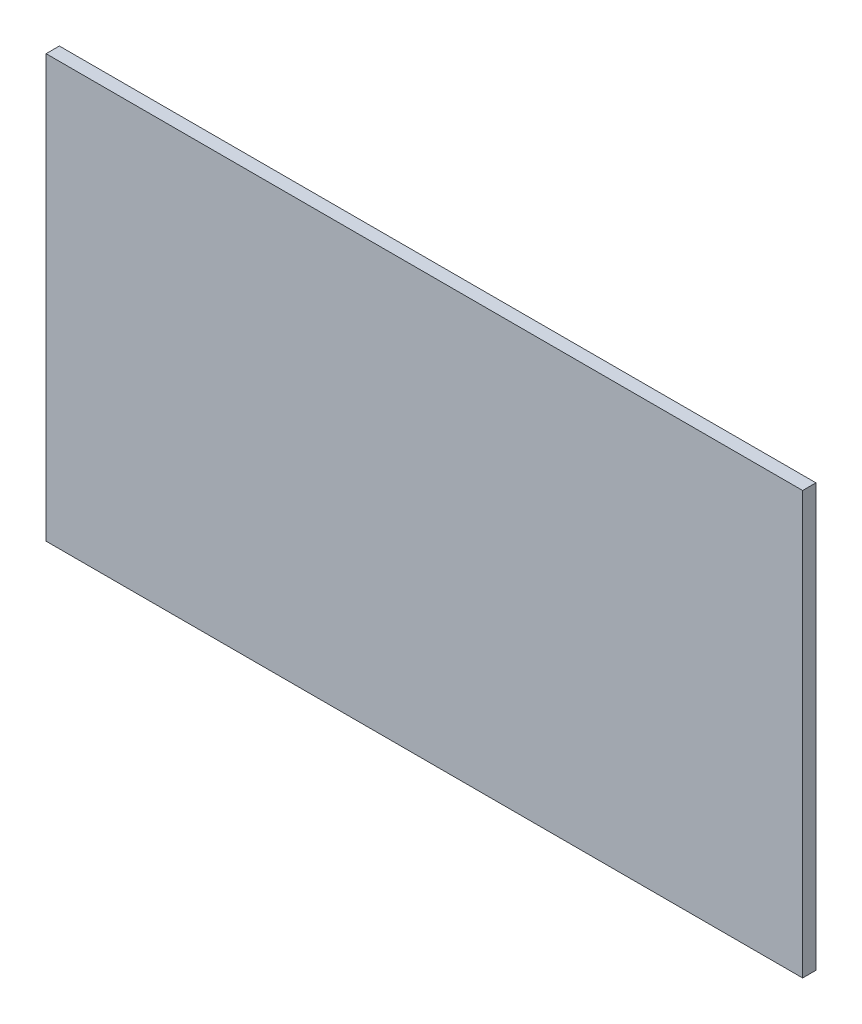
ISO-10303-21;
HEADER;
FILE_DESCRIPTION(('STEP AP214'),'2;1');
FILE_NAME('part.step','',(''),(''),'','','');
FILE_SCHEMA(('AUTOMOTIVE_DESIGN { 1 0 10303 214 1 1 1 1 }'));
ENDSEC;
DATA;
#1=APPLICATION_CONTEXT('core data for automotive mechanical design processes');
#2=APPLICATION_PROTOCOL_DEFINITION('international standard','automotive_design',2000,#1);
#3=PRODUCT_CONTEXT('',#1,'mechanical');
#4=PRODUCT('Part','Part','',(#3));
#5=PRODUCT_RELATED_PRODUCT_CATEGORY('part','',(#4));
#6=PRODUCT_DEFINITION_FORMATION('','',#4);
#7=PRODUCT_DEFINITION_CONTEXT('part definition',#1,'design');
#8=PRODUCT_DEFINITION('design','',#6,#7);
#9=PRODUCT_DEFINITION_SHAPE('','',#8);
#10=(LENGTH_UNIT() NAMED_UNIT(*) SI_UNIT(.MILLI.,.METRE.));
#11=(NAMED_UNIT(*) PLANE_ANGLE_UNIT() SI_UNIT($,.RADIAN.));
#12=(NAMED_UNIT(*) SI_UNIT($,.STERADIAN.) SOLID_ANGLE_UNIT());
#13=UNCERTAINTY_MEASURE_WITH_UNIT(LENGTH_MEASURE(1.E-05),#10,'distance_accuracy_value','');
#14=(GEOMETRIC_REPRESENTATION_CONTEXT(3) GLOBAL_UNCERTAINTY_ASSIGNED_CONTEXT((#13)) GLOBAL_UNIT_ASSIGNED_CONTEXT((#10,
#11,#12)) REPRESENTATION_CONTEXT('',''));
#15=CARTESIAN_POINT('',(0.,0.,0.));
#16=DIRECTION('',(0.,0.,1.));
#17=DIRECTION('',(1.,0.,0.));
#18=AXIS2_PLACEMENT_3D('',#15,#16,#17);
#19=CARTESIAN_POINT('',(-512.5,-286.,18.));
#20=DIRECTION('',(1.,0.,0.));
#21=DIRECTION('',(0.,0.,-1.));
#22=AXIS2_PLACEMENT_3D('',#19,#20,#21);
#23=PLANE('',#22);
#24=DIRECTION('',(0.,-1.,0.));
#25=VECTOR('',#24,1.);
#26=CARTESIAN_POINT('',(-512.5,-286.,0.));
#27=LINE('',#26,#25);
#28=CARTESIAN_POINT('',(-512.5,286.,0.));
#29=VERTEX_POINT('',#28);
#30=CARTESIAN_POINT('',(-512.5,-286.,0.));
#31=VERTEX_POINT('',#30);
#32=EDGE_CURVE('E96',#29,#31,#27,.T.);
#33=ORIENTED_EDGE('',*,*,#32,.T.);
#34=DIRECTION('',(0.,0.,-1.));
#35=VECTOR('',#34,1.);
#36=CARTESIAN_POINT('',(-512.5,-286.,18.));
#37=LINE('',#36,#35);
#38=CARTESIAN_POINT('',(-512.5,-286.,18.));
#39=VERTEX_POINT('',#38);
#40=EDGE_CURVE('E11',#39,#31,#37,.T.);
#41=ORIENTED_EDGE('',*,*,#40,.F.);
#42=DIRECTION('',(0.,-1.,0.));
#43=VECTOR('',#42,1.);
#44=CARTESIAN_POINT('',(-512.5,-286.,18.));
#45=LINE('',#44,#43);
#46=CARTESIAN_POINT('',(-512.5,286.,18.));
#47=VERTEX_POINT('',#46);
#48=EDGE_CURVE('E84',#47,#39,#45,.T.);
#49=ORIENTED_EDGE('',*,*,#48,.F.);
#50=DIRECTION('',(0.,0.,-1.));
#51=VECTOR('',#50,1.);
#52=CARTESIAN_POINT('',(-512.5,286.,18.));
#53=LINE('',#52,#51);
#54=EDGE_CURVE('E92',#47,#29,#53,.T.);
#55=ORIENTED_EDGE('',*,*,#54,.T.);
#56=EDGE_LOOP('',(#33,#41,#49,#55));
#57=FACE_BOUND('',#56,.T.);
#58=ADVANCED_FACE('F33',(#57),#23,.F.);
#59=CARTESIAN_POINT('',(512.5,-286.,18.));
#60=DIRECTION('',(0.,1.,0.));
#61=DIRECTION('',(-1.,0.,0.));
#62=AXIS2_PLACEMENT_3D('',#59,#60,#61);
#63=PLANE('',#62);
#64=DIRECTION('',(1.,0.,0.));
#65=VECTOR('',#64,1.);
#66=CARTESIAN_POINT('',(512.5,-286.,0.));
#67=LINE('',#66,#65);
#68=CARTESIAN_POINT('',(512.5,-286.,0.));
#69=VERTEX_POINT('',#68);
#70=EDGE_CURVE('E88',#31,#69,#67,.T.);
#71=ORIENTED_EDGE('',*,*,#70,.T.);
#72=DIRECTION('',(0.,0.,-1.));
#73=VECTOR('',#72,1.);
#74=CARTESIAN_POINT('',(512.5,-286.,18.));
#75=LINE('',#74,#73);
#76=CARTESIAN_POINT('',(512.5,-286.,18.));
#77=VERTEX_POINT('',#76);
#78=EDGE_CURVE('E41',#77,#69,#75,.T.);
#79=ORIENTED_EDGE('',*,*,#78,.F.);
#80=DIRECTION('',(1.,0.,0.));
#81=VECTOR('',#80,1.);
#82=CARTESIAN_POINT('',(512.5,-286.,18.));
#83=LINE('',#82,#81);
#84=EDGE_CURVE('E79',#39,#77,#83,.T.);
#85=ORIENTED_EDGE('',*,*,#84,.F.);
#86=ORIENTED_EDGE('',*,*,#40,.T.);
#87=EDGE_LOOP('',(#71,#79,#85,#86));
#88=FACE_BOUND('',#87,.T.);
#89=ADVANCED_FACE('F87',(#88),#63,.F.);
#90=CARTESIAN_POINT('',(512.5,-286.,18.));
#91=DIRECTION('',(-1.,0.,0.));
#92=DIRECTION('',(0.,0.,1.));
#93=AXIS2_PLACEMENT_3D('',#90,#91,#92);
#94=PLANE('',#93);
#95=DIRECTION('',(0.,1.,0.));
#96=VECTOR('',#95,1.);
#97=CARTESIAN_POINT('',(512.5,-286.,0.));
#98=LINE('',#97,#96);
#99=CARTESIAN_POINT('',(512.5,286.,0.));
#100=VERTEX_POINT('',#99);
#101=EDGE_CURVE('E66',#69,#100,#98,.T.);
#102=ORIENTED_EDGE('',*,*,#101,.T.);
#103=DIRECTION('',(0.,0.,-1.));
#104=VECTOR('',#103,1.);
#105=CARTESIAN_POINT('',(512.5,286.,18.));
#106=LINE('',#105,#104);
#107=CARTESIAN_POINT('',(512.5,286.,18.));
#108=VERTEX_POINT('',#107);
#109=EDGE_CURVE('E89',#108,#100,#106,.T.);
#110=ORIENTED_EDGE('',*,*,#109,.F.);
#111=DIRECTION('',(0.,1.,0.));
#112=VECTOR('',#111,1.);
#113=CARTESIAN_POINT('',(512.5,-286.,18.));
#114=LINE('',#113,#112);
#115=EDGE_CURVE('E82',#77,#108,#114,.T.);
#116=ORIENTED_EDGE('',*,*,#115,.F.);
#117=ORIENTED_EDGE('',*,*,#78,.T.);
#118=EDGE_LOOP('',(#102,#110,#116,#117));
#119=FACE_BOUND('',#118,.T.);
#120=ADVANCED_FACE('F90',(#119),#94,.F.);
#121=CARTESIAN_POINT('',(512.5,286.,18.));
#122=DIRECTION('',(0.,-1.,0.));
#123=DIRECTION('',(1.,0.,0.));
#124=AXIS2_PLACEMENT_3D('',#121,#122,#123);
#125=PLANE('',#124);
#126=DIRECTION('',(-1.,0.,0.));
#127=VECTOR('',#126,1.);
#128=CARTESIAN_POINT('',(512.5,286.,0.));
#129=LINE('',#128,#127);
#130=EDGE_CURVE('E72',#100,#29,#129,.T.);
#131=ORIENTED_EDGE('',*,*,#130,.T.);
#132=ORIENTED_EDGE('',*,*,#54,.F.);
#133=DIRECTION('',(-1.,0.,0.));
#134=VECTOR('',#133,1.);
#135=CARTESIAN_POINT('',(512.5,286.,18.));
#136=LINE('',#135,#134);
#137=EDGE_CURVE('E49',#108,#47,#136,.T.);
#138=ORIENTED_EDGE('',*,*,#137,.F.);
#139=ORIENTED_EDGE('',*,*,#109,.T.);
#140=EDGE_LOOP('',(#131,#132,#138,#139));
#141=FACE_BOUND('',#140,.T.);
#142=ADVANCED_FACE('F103',(#141),#125,.F.);
#143=CARTESIAN_POINT('',(0.,0.,18.));
#144=DIRECTION('',(0.,0.,1.));
#145=DIRECTION('',(1.,0.,0.));
#146=AXIS2_PLACEMENT_3D('',#143,#144,#145);
#147=PLANE('',#146);
#148=ORIENTED_EDGE('',*,*,#48,.T.);
#149=ORIENTED_EDGE('',*,*,#84,.T.);
#150=ORIENTED_EDGE('',*,*,#115,.T.);
#151=ORIENTED_EDGE('',*,*,#137,.T.);
#152=EDGE_LOOP('',(#148,#149,#150,#151));
#153=FACE_BOUND('',#152,.T.);
#154=ADVANCED_FACE('F80',(#153),#147,.T.);
#155=CARTESIAN_POINT('',(0.,0.,0.));
#156=DIRECTION('',(0.,0.,1.));
#157=DIRECTION('',(1.,0.,0.));
#158=AXIS2_PLACEMENT_3D('',#155,#156,#157);
#159=PLANE('',#158);
#160=ORIENTED_EDGE('',*,*,#32,.F.);
#161=ORIENTED_EDGE('',*,*,#130,.F.);
#162=ORIENTED_EDGE('',*,*,#101,.F.);
#163=ORIENTED_EDGE('',*,*,#70,.F.);
#164=EDGE_LOOP('',(#160,#161,#162,#163));
#165=FACE_BOUND('',#164,.T.);
#166=ADVANCED_FACE('F106',(#165),#159,.F.);
#167=CLOSED_SHELL('',(#58,#89,#120,#142,#154,#166));
#168=MANIFOLD_SOLID_BREP('B2',#167);
#169=ADVANCED_BREP_SHAPE_REPRESENTATION('',(#18,#168),#14);
#170=SHAPE_DEFINITION_REPRESENTATION(#9,#169);
ENDSEC;
END-ISO-10303-21;
